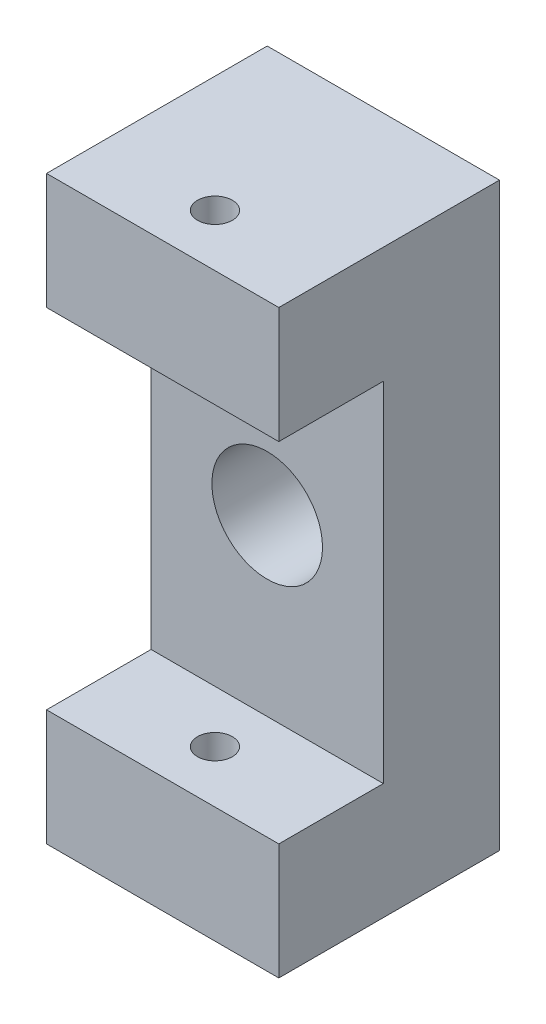
ISO-10303-21;
HEADER;
FILE_DESCRIPTION(('STEP AP214'),'2;1');
FILE_NAME('part.step','',(''),(''),'','','');
FILE_SCHEMA(('AUTOMOTIVE_DESIGN { 1 0 10303 214 1 1 1 1 }'));
ENDSEC;
DATA;
#1=APPLICATION_CONTEXT('core data for automotive mechanical design processes');
#2=APPLICATION_PROTOCOL_DEFINITION('international standard','automotive_design',2000,#1);
#3=PRODUCT_CONTEXT('',#1,'mechanical');
#4=PRODUCT('Part','Part','',(#3));
#5=PRODUCT_RELATED_PRODUCT_CATEGORY('part','',(#4));
#6=PRODUCT_DEFINITION_FORMATION('','',#4);
#7=PRODUCT_DEFINITION_CONTEXT('part definition',#1,'design');
#8=PRODUCT_DEFINITION('design','',#6,#7);
#9=PRODUCT_DEFINITION_SHAPE('','',#8);
#10=(LENGTH_UNIT() NAMED_UNIT(*) SI_UNIT(.MILLI.,.METRE.));
#11=(NAMED_UNIT(*) PLANE_ANGLE_UNIT() SI_UNIT($,.RADIAN.));
#12=(NAMED_UNIT(*) SI_UNIT($,.STERADIAN.) SOLID_ANGLE_UNIT());
#13=UNCERTAINTY_MEASURE_WITH_UNIT(LENGTH_MEASURE(1.E-05),#10,'distance_accuracy_value','');
#14=(GEOMETRIC_REPRESENTATION_CONTEXT(3) GLOBAL_UNCERTAINTY_ASSIGNED_CONTEXT((#13)) GLOBAL_UNIT_ASSIGNED_CONTEXT((#10,
#11,#12)) REPRESENTATION_CONTEXT('',''));
#15=CARTESIAN_POINT('',(0.,0.,0.));
#16=DIRECTION('',(0.,0.,1.));
#17=DIRECTION('',(1.,0.,0.));
#18=AXIS2_PLACEMENT_3D('',#15,#16,#17);
#19=CARTESIAN_POINT('',(20.,0.,10.));
#20=DIRECTION('',(-1.,0.,0.));
#21=DIRECTION('',(0.,0.,1.));
#22=AXIS2_PLACEMENT_3D('',#19,#20,#21);
#23=PLANE('',#22);
#24=DIRECTION('',(0.,1.,0.));
#25=VECTOR('',#24,1.);
#26=CARTESIAN_POINT('',(20.,0.,0.));
#27=LINE('',#26,#25);
#28=CARTESIAN_POINT('',(20.,-10.,0.));
#29=VERTEX_POINT('',#28);
#30=CARTESIAN_POINT('',(20.,40.,0.));
#31=VERTEX_POINT('',#30);
#32=EDGE_CURVE('E117',#29,#31,#27,.T.);
#33=ORIENTED_EDGE('',*,*,#32,.T.);
#34=DIRECTION('',(0.,0.,-1.));
#35=VECTOR('',#34,1.);
#36=CARTESIAN_POINT('',(20.,40.,19.));
#37=LINE('',#36,#35);
#38=CARTESIAN_POINT('',(20.,40.,19.));
#39=VERTEX_POINT('',#38);
#40=EDGE_CURVE('E120',#39,#31,#37,.T.);
#41=ORIENTED_EDGE('',*,*,#40,.F.);
#42=DIRECTION('',(0.,1.,0.));
#43=VECTOR('',#42,1.);
#44=CARTESIAN_POINT('',(20.,40.,19.));
#45=LINE('',#44,#43);
#46=CARTESIAN_POINT('',(20.,30.,19.));
#47=VERTEX_POINT('',#46);
#48=EDGE_CURVE('E138',#47,#39,#45,.T.);
#49=ORIENTED_EDGE('',*,*,#48,.F.);
#50=DIRECTION('',(0.,0.,-1.));
#51=VECTOR('',#50,1.);
#52=CARTESIAN_POINT('',(20.,30.,19.));
#53=LINE('',#52,#51);
#54=CARTESIAN_POINT('',(20.,30.,10.));
#55=VERTEX_POINT('',#54);
#56=EDGE_CURVE('E139',#47,#55,#53,.T.);
#57=ORIENTED_EDGE('',*,*,#56,.T.);
#58=DIRECTION('',(0.,1.,0.));
#59=VECTOR('',#58,1.);
#60=CARTESIAN_POINT('',(20.,0.,10.));
#61=LINE('',#60,#59);
#62=CARTESIAN_POINT('',(20.,0.,10.));
#63=VERTEX_POINT('',#62);
#64=EDGE_CURVE('E193',#63,#55,#61,.T.);
#65=ORIENTED_EDGE('',*,*,#64,.F.);
#66=DIRECTION('',(0.,0.,-1.));
#67=VECTOR('',#66,1.);
#68=CARTESIAN_POINT('',(20.,0.,19.));
#69=LINE('',#68,#67);
#70=CARTESIAN_POINT('',(20.,0.,19.));
#71=VERTEX_POINT('',#70);
#72=EDGE_CURVE('E73',#71,#63,#69,.T.);
#73=ORIENTED_EDGE('',*,*,#72,.F.);
#74=DIRECTION('',(0.,1.,0.));
#75=VECTOR('',#74,1.);
#76=CARTESIAN_POINT('',(20.,-10.,19.));
#77=LINE('',#76,#75);
#78=CARTESIAN_POINT('',(20.,-10.,19.));
#79=VERTEX_POINT('',#78);
#80=EDGE_CURVE('E164',#79,#71,#77,.T.);
#81=ORIENTED_EDGE('',*,*,#80,.F.);
#82=DIRECTION('',(0.,0.,-1.));
#83=VECTOR('',#82,1.);
#84=CARTESIAN_POINT('',(20.,-10.,19.));
#85=LINE('',#84,#83);
#86=EDGE_CURVE('E123',#79,#29,#85,.T.);
#87=ORIENTED_EDGE('',*,*,#86,.T.);
#88=EDGE_LOOP('',(#33,#41,#49,#57,#65,#73,#81,#87));
#89=FACE_BOUND('',#88,.T.);
#90=ADVANCED_FACE('F49',(#89),#23,.F.);
#91=CARTESIAN_POINT('',(10.,15.,10.));
#92=DIRECTION('',(0.,0.,-1.));
#93=DIRECTION('',(-1.,0.,0.));
#94=AXIS2_PLACEMENT_3D('',#91,#92,#93);
#95=CYLINDRICAL_SURFACE('',#94,4.7625);
#96=CARTESIAN_POINT('',(10.,15.,10.));
#97=DIRECTION('',(0.,0.,1.));
#98=DIRECTION('',(1.,0.,0.));
#99=AXIS2_PLACEMENT_3D('',#96,#97,#98);
#100=CIRCLE('',#99,4.7625);
#101=CARTESIAN_POINT('',(14.7625,15.,10.));
#102=VERTEX_POINT('',#101);
#103=EDGE_CURVE('E185',#102,#102,#100,.T.);
#104=ORIENTED_EDGE('',*,*,#103,.T.);
#105=EDGE_LOOP('',(#104));
#106=FACE_BOUND('',#105,.T.);
#107=CARTESIAN_POINT('',(10.,15.,0.));
#108=DIRECTION('',(0.,0.,1.));
#109=DIRECTION('',(1.,0.,0.));
#110=AXIS2_PLACEMENT_3D('',#107,#108,#109);
#111=CIRCLE('',#110,4.7625);
#112=CARTESIAN_POINT('',(14.7625,15.,0.));
#113=VERTEX_POINT('',#112);
#114=EDGE_CURVE('E129',#113,#113,#111,.T.);
#115=ORIENTED_EDGE('',*,*,#114,.F.);
#116=EDGE_LOOP('',(#115));
#117=FACE_BOUND('',#116,.T.);
#118=ADVANCED_FACE('F51',(#106,#117),#95,.F.);
#119=CARTESIAN_POINT('',(0.,0.,10.));
#120=DIRECTION('',(-1.,0.,0.));
#121=DIRECTION('',(0.,0.,1.));
#122=AXIS2_PLACEMENT_3D('',#119,#120,#121);
#123=PLANE('',#122);
#124=DIRECTION('',(0.,1.,0.));
#125=VECTOR('',#124,1.);
#126=CARTESIAN_POINT('',(0.,0.,0.));
#127=LINE('',#126,#125);
#128=CARTESIAN_POINT('',(0.,-10.,0.));
#129=VERTEX_POINT('',#128);
#130=CARTESIAN_POINT('',(0.,40.,0.));
#131=VERTEX_POINT('',#130);
#132=EDGE_CURVE('E53',#129,#131,#127,.T.);
#133=ORIENTED_EDGE('',*,*,#132,.F.);
#134=DIRECTION('',(0.,0.,-1.));
#135=VECTOR('',#134,1.);
#136=CARTESIAN_POINT('',(0.,-10.,19.));
#137=LINE('',#136,#135);
#138=CARTESIAN_POINT('',(0.,-10.,19.));
#139=VERTEX_POINT('',#138);
#140=EDGE_CURVE('E172',#139,#129,#137,.T.);
#141=ORIENTED_EDGE('',*,*,#140,.F.);
#142=DIRECTION('',(0.,-1.,0.));
#143=VECTOR('',#142,1.);
#144=CARTESIAN_POINT('',(0.,0.,19.));
#145=LINE('',#144,#143);
#146=CARTESIAN_POINT('',(0.,0.,19.));
#147=VERTEX_POINT('',#146);
#148=EDGE_CURVE('E170',#147,#139,#145,.T.);
#149=ORIENTED_EDGE('',*,*,#148,.F.);
#150=DIRECTION('',(0.,0.,-1.));
#151=VECTOR('',#150,1.);
#152=CARTESIAN_POINT('',(0.,0.,19.));
#153=LINE('',#152,#151);
#154=CARTESIAN_POINT('',(0.,0.,10.));
#155=VERTEX_POINT('',#154);
#156=EDGE_CURVE('E177',#147,#155,#153,.T.);
#157=ORIENTED_EDGE('',*,*,#156,.T.);
#158=DIRECTION('',(0.,1.,0.));
#159=VECTOR('',#158,1.);
#160=CARTESIAN_POINT('',(0.,0.,10.));
#161=LINE('',#160,#159);
#162=CARTESIAN_POINT('',(0.,30.,10.));
#163=VERTEX_POINT('',#162);
#164=EDGE_CURVE('E11',#155,#163,#161,.T.);
#165=ORIENTED_EDGE('',*,*,#164,.T.);
#166=DIRECTION('',(0.,0.,-1.));
#167=VECTOR('',#166,1.);
#168=CARTESIAN_POINT('',(0.,30.,19.));
#169=LINE('',#168,#167);
#170=CARTESIAN_POINT('',(0.,30.,19.));
#171=VERTEX_POINT('',#170);
#172=EDGE_CURVE('E231',#171,#163,#169,.T.);
#173=ORIENTED_EDGE('',*,*,#172,.F.);
#174=DIRECTION('',(0.,-1.,0.));
#175=VECTOR('',#174,1.);
#176=CARTESIAN_POINT('',(0.,30.,19.));
#177=LINE('',#176,#175);
#178=CARTESIAN_POINT('',(0.,40.,19.));
#179=VERTEX_POINT('',#178);
#180=EDGE_CURVE('E150',#179,#171,#177,.T.);
#181=ORIENTED_EDGE('',*,*,#180,.F.);
#182=DIRECTION('',(0.,0.,-1.));
#183=VECTOR('',#182,1.);
#184=CARTESIAN_POINT('',(0.,40.,19.));
#185=LINE('',#184,#183);
#186=EDGE_CURVE('E233',#179,#131,#185,.T.);
#187=ORIENTED_EDGE('',*,*,#186,.T.);
#188=EDGE_LOOP('',(#133,#141,#149,#157,#165,#173,#181,#187));
#189=FACE_BOUND('',#188,.T.);
#190=ADVANCED_FACE('F204',(#189),#123,.T.);
#191=CARTESIAN_POINT('',(0.,0.,10.));
#192=DIRECTION('',(0.,0.,1.));
#193=DIRECTION('',(1.,0.,0.));
#194=AXIS2_PLACEMENT_3D('',#191,#192,#193);
#195=PLANE('',#194);
#196=ORIENTED_EDGE('',*,*,#103,.F.);
#197=EDGE_LOOP('',(#196));
#198=FACE_BOUND('',#197,.T.);
#199=DIRECTION('',(1.,0.,0.));
#200=VECTOR('',#199,1.);
#201=CARTESIAN_POINT('',(0.,0.,10.));
#202=LINE('',#201,#200);
#203=EDGE_CURVE('E189',#155,#63,#202,.T.);
#204=ORIENTED_EDGE('',*,*,#203,.T.);
#205=ORIENTED_EDGE('',*,*,#64,.T.);
#206=DIRECTION('',(1.,0.,0.));
#207=VECTOR('',#206,1.);
#208=CARTESIAN_POINT('',(0.,30.,10.));
#209=LINE('',#208,#207);
#210=EDGE_CURVE('E59',#163,#55,#209,.T.);
#211=ORIENTED_EDGE('',*,*,#210,.F.);
#212=ORIENTED_EDGE('',*,*,#164,.F.);
#213=EDGE_LOOP('',(#204,#205,#211,#212));
#214=FACE_BOUND('',#213,.T.);
#215=ADVANCED_FACE('F210',(#198,#214),#195,.T.);
#216=CARTESIAN_POINT('',(0.,0.,0.));
#217=DIRECTION('',(0.,0.,1.));
#218=DIRECTION('',(1.,0.,0.));
#219=AXIS2_PLACEMENT_3D('',#216,#217,#218);
#220=PLANE('',#219);
#221=ORIENTED_EDGE('',*,*,#114,.T.);
#222=EDGE_LOOP('',(#221));
#223=FACE_BOUND('',#222,.T.);
#224=ORIENTED_EDGE('',*,*,#32,.F.);
#225=DIRECTION('',(1.,0.,0.));
#226=VECTOR('',#225,1.);
#227=CARTESIAN_POINT('',(0.,-10.,0.));
#228=LINE('',#227,#226);
#229=EDGE_CURVE('E144',#129,#29,#228,.T.);
#230=ORIENTED_EDGE('',*,*,#229,.F.);
#231=ORIENTED_EDGE('',*,*,#132,.T.);
#232=DIRECTION('',(-1.,0.,0.));
#233=VECTOR('',#232,1.);
#234=CARTESIAN_POINT('',(0.,40.,0.));
#235=LINE('',#234,#233);
#236=EDGE_CURVE('E134',#31,#131,#235,.T.);
#237=ORIENTED_EDGE('',*,*,#236,.F.);
#238=EDGE_LOOP('',(#224,#230,#231,#237));
#239=FACE_BOUND('',#238,.T.);
#240=ADVANCED_FACE('F141',(#223,#239),#220,.F.);
#241=CARTESIAN_POINT('',(0.,-10.,19.));
#242=DIRECTION('',(0.,1.,0.));
#243=DIRECTION('',(0.,0.,1.));
#244=AXIS2_PLACEMENT_3D('',#241,#242,#243);
#245=PLANE('',#244);
#246=CARTESIAN_POINT('',(10.,-10.,14.5));
#247=DIRECTION('',(0.,1.,0.));
#248=DIRECTION('',(0.,0.,1.));
#249=AXIS2_PLACEMENT_3D('',#246,#247,#248);
#250=CIRCLE('',#249,1.5);
#251=CARTESIAN_POINT('',(10.,-10.,16.));
#252=VERTEX_POINT('',#251);
#253=EDGE_CURVE('E246',#252,#252,#250,.T.);
#254=ORIENTED_EDGE('',*,*,#253,.T.);
#255=EDGE_LOOP('',(#254));
#256=FACE_BOUND('',#255,.T.);
#257=ORIENTED_EDGE('',*,*,#229,.T.);
#258=ORIENTED_EDGE('',*,*,#86,.F.);
#259=DIRECTION('',(1.,0.,0.));
#260=VECTOR('',#259,1.);
#261=CARTESIAN_POINT('',(0.,-10.,19.));
#262=LINE('',#261,#260);
#263=EDGE_CURVE('E148',#139,#79,#262,.T.);
#264=ORIENTED_EDGE('',*,*,#263,.F.);
#265=ORIENTED_EDGE('',*,*,#140,.T.);
#266=EDGE_LOOP('',(#257,#258,#264,#265));
#267=FACE_BOUND('',#266,.T.);
#268=ADVANCED_FACE('F255',(#256,#267),#245,.F.);
#269=CARTESIAN_POINT('',(0.,0.,19.));
#270=DIRECTION('',(0.,-1.,0.));
#271=DIRECTION('',(0.,0.,-1.));
#272=AXIS2_PLACEMENT_3D('',#269,#270,#271);
#273=PLANE('',#272);
#274=CARTESIAN_POINT('',(10.,0.,14.5));
#275=DIRECTION('',(0.,-1.,0.));
#276=DIRECTION('',(0.,0.,-1.));
#277=AXIS2_PLACEMENT_3D('',#274,#275,#276);
#278=CIRCLE('',#277,1.5);
#279=CARTESIAN_POINT('',(10.,0.,13.));
#280=VERTEX_POINT('',#279);
#281=EDGE_CURVE('E238',#280,#280,#278,.T.);
#282=ORIENTED_EDGE('',*,*,#281,.T.);
#283=EDGE_LOOP('',(#282));
#284=FACE_BOUND('',#283,.T.);
#285=ORIENTED_EDGE('',*,*,#203,.F.);
#286=ORIENTED_EDGE('',*,*,#156,.F.);
#287=DIRECTION('',(-1.,0.,0.));
#288=VECTOR('',#287,1.);
#289=CARTESIAN_POINT('',(0.,0.,19.));
#290=LINE('',#289,#288);
#291=EDGE_CURVE('E167',#71,#147,#290,.T.);
#292=ORIENTED_EDGE('',*,*,#291,.F.);
#293=ORIENTED_EDGE('',*,*,#72,.T.);
#294=EDGE_LOOP('',(#285,#286,#292,#293));
#295=FACE_BOUND('',#294,.T.);
#296=ADVANCED_FACE('F218',(#284,#295),#273,.F.);
#297=CARTESIAN_POINT('',(0.,0.,19.));
#298=DIRECTION('',(0.,0.,1.));
#299=DIRECTION('',(1.,0.,0.));
#300=AXIS2_PLACEMENT_3D('',#297,#298,#299);
#301=PLANE('',#300);
#302=ORIENTED_EDGE('',*,*,#263,.T.);
#303=ORIENTED_EDGE('',*,*,#80,.T.);
#304=ORIENTED_EDGE('',*,*,#291,.T.);
#305=ORIENTED_EDGE('',*,*,#148,.T.);
#306=EDGE_LOOP('',(#302,#303,#304,#305));
#307=FACE_BOUND('',#306,.T.);
#308=ADVANCED_FACE('F225',(#307),#301,.T.);
#309=CARTESIAN_POINT('',(0.,30.,19.));
#310=DIRECTION('',(0.,1.,0.));
#311=DIRECTION('',(0.,0.,1.));
#312=AXIS2_PLACEMENT_3D('',#309,#310,#311);
#313=PLANE('',#312);
#314=CARTESIAN_POINT('',(10.,30.,14.5));
#315=DIRECTION('',(0.,1.,0.));
#316=DIRECTION('',(0.,0.,1.));
#317=AXIS2_PLACEMENT_3D('',#314,#315,#316);
#318=CIRCLE('',#317,1.5);
#319=CARTESIAN_POINT('',(10.,30.,16.));
#320=VERTEX_POINT('',#319);
#321=EDGE_CURVE('E242',#320,#320,#318,.T.);
#322=ORIENTED_EDGE('',*,*,#321,.T.);
#323=EDGE_LOOP('',(#322));
#324=FACE_BOUND('',#323,.T.);
#325=ORIENTED_EDGE('',*,*,#172,.T.);
#326=ORIENTED_EDGE('',*,*,#210,.T.);
#327=ORIENTED_EDGE('',*,*,#56,.F.);
#328=DIRECTION('',(1.,0.,0.));
#329=VECTOR('',#328,1.);
#330=CARTESIAN_POINT('',(0.,30.,19.));
#331=LINE('',#330,#329);
#332=EDGE_CURVE('E156',#171,#47,#331,.T.);
#333=ORIENTED_EDGE('',*,*,#332,.F.);
#334=EDGE_LOOP('',(#325,#326,#327,#333));
#335=FACE_BOUND('',#334,.T.);
#336=ADVANCED_FACE('F272',(#324,#335),#313,.F.);
#337=CARTESIAN_POINT('',(0.,40.,19.));
#338=DIRECTION('',(0.,-1.,0.));
#339=DIRECTION('',(0.,0.,-1.));
#340=AXIS2_PLACEMENT_3D('',#337,#338,#339);
#341=PLANE('',#340);
#342=CARTESIAN_POINT('',(10.,40.,14.5));
#343=DIRECTION('',(0.,1.,0.));
#344=DIRECTION('',(0.,0.,1.));
#345=AXIS2_PLACEMENT_3D('',#342,#343,#344);
#346=CIRCLE('',#345,1.5);
#347=CARTESIAN_POINT('',(10.,40.,16.));
#348=VERTEX_POINT('',#347);
#349=EDGE_CURVE('E247',#348,#348,#346,.T.);
#350=ORIENTED_EDGE('',*,*,#349,.F.);
#351=EDGE_LOOP('',(#350));
#352=FACE_BOUND('',#351,.T.);
#353=ORIENTED_EDGE('',*,*,#236,.T.);
#354=ORIENTED_EDGE('',*,*,#186,.F.);
#355=DIRECTION('',(-1.,0.,0.));
#356=VECTOR('',#355,1.);
#357=CARTESIAN_POINT('',(0.,40.,19.));
#358=LINE('',#357,#356);
#359=EDGE_CURVE('E136',#39,#179,#358,.T.);
#360=ORIENTED_EDGE('',*,*,#359,.F.);
#361=ORIENTED_EDGE('',*,*,#40,.T.);
#362=EDGE_LOOP('',(#353,#354,#360,#361));
#363=FACE_BOUND('',#362,.T.);
#364=ADVANCED_FACE('F132',(#352,#363),#341,.F.);
#365=CARTESIAN_POINT('',(0.,0.,19.));
#366=DIRECTION('',(0.,0.,-1.));
#367=DIRECTION('',(-1.,0.,0.));
#368=AXIS2_PLACEMENT_3D('',#365,#366,#367);
#369=PLANE('',#368);
#370=ORIENTED_EDGE('',*,*,#359,.T.);
#371=ORIENTED_EDGE('',*,*,#180,.T.);
#372=ORIENTED_EDGE('',*,*,#332,.T.);
#373=ORIENTED_EDGE('',*,*,#48,.T.);
#374=EDGE_LOOP('',(#370,#371,#372,#373));
#375=FACE_BOUND('',#374,.T.);
#376=ADVANCED_FACE('F293',(#375),#369,.F.);
#377=CARTESIAN_POINT('',(10.,-10.,14.5));
#378=DIRECTION('',(0.,1.,0.));
#379=DIRECTION('',(0.,0.,1.));
#380=AXIS2_PLACEMENT_3D('',#377,#378,#379);
#381=CYLINDRICAL_SURFACE('',#380,1.5);
#382=ORIENTED_EDGE('',*,*,#349,.T.);
#383=EDGE_LOOP('',(#382));
#384=FACE_BOUND('',#383,.T.);
#385=ORIENTED_EDGE('',*,*,#321,.F.);
#386=EDGE_LOOP('',(#385));
#387=FACE_BOUND('',#386,.T.);
#388=ADVANCED_FACE('F261',(#384,#387),#381,.F.);
#389=ORIENTED_EDGE('',*,*,#253,.F.);
#390=EDGE_LOOP('',(#389));
#391=FACE_BOUND('',#390,.T.);
#392=ORIENTED_EDGE('',*,*,#281,.F.);
#393=EDGE_LOOP('',(#392));
#394=FACE_BOUND('',#393,.T.);
#395=ADVANCED_FACE('F258',(#391,#394),#381,.F.);
#396=CLOSED_SHELL('',(#90,#118,#190,#215,#240,#268,#296,#308,#336,#364,#376,#388,#395));
#397=MANIFOLD_SOLID_BREP('B2',#396);
#398=ADVANCED_BREP_SHAPE_REPRESENTATION('',(#18,#397),#14);
#399=SHAPE_DEFINITION_REPRESENTATION(#9,#398);
ENDSEC;
END-ISO-10303-21;
